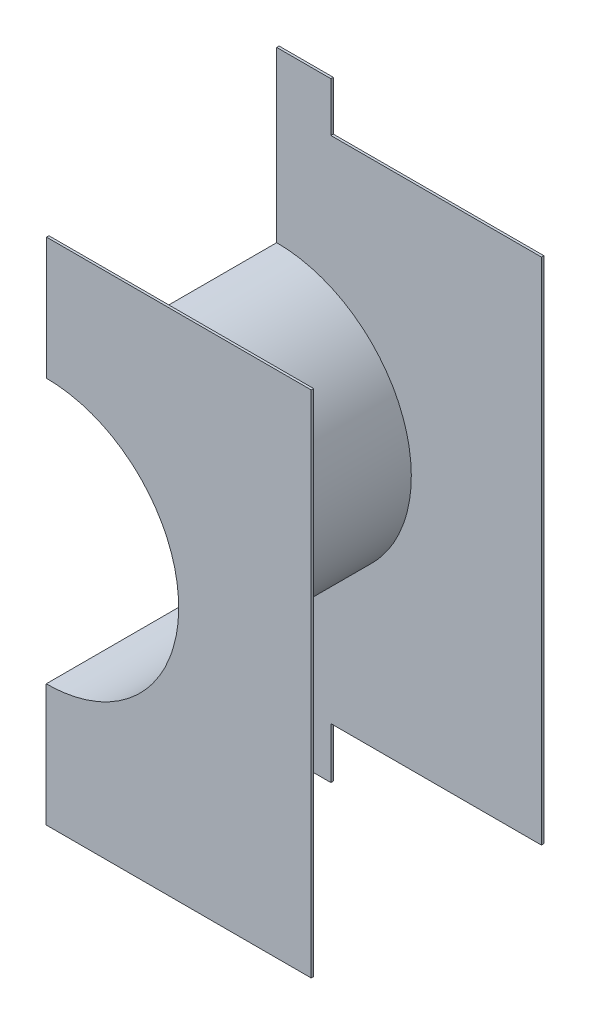
ISO-10303-21;
HEADER;
FILE_DESCRIPTION(('STEP AP214'),'2;1');
FILE_NAME('part.step','',(''),(''),'','','');
FILE_SCHEMA(('AUTOMOTIVE_DESIGN { 1 0 10303 214 1 1 1 1 }'));
ENDSEC;
DATA;
#1=APPLICATION_CONTEXT('core data for automotive mechanical design processes');
#2=APPLICATION_PROTOCOL_DEFINITION('international standard','automotive_design',2000,#1);
#3=PRODUCT_CONTEXT('',#1,'mechanical');
#4=PRODUCT('Part','Part','',(#3));
#5=PRODUCT_RELATED_PRODUCT_CATEGORY('part','',(#4));
#6=PRODUCT_DEFINITION_FORMATION('','',#4);
#7=PRODUCT_DEFINITION_CONTEXT('part definition',#1,'design');
#8=PRODUCT_DEFINITION('design','',#6,#7);
#9=PRODUCT_DEFINITION_SHAPE('','',#8);
#10=(LENGTH_UNIT() NAMED_UNIT(*) SI_UNIT(.MILLI.,.METRE.));
#11=(NAMED_UNIT(*) PLANE_ANGLE_UNIT() SI_UNIT($,.RADIAN.));
#12=(NAMED_UNIT(*) SI_UNIT($,.STERADIAN.) SOLID_ANGLE_UNIT());
#13=UNCERTAINTY_MEASURE_WITH_UNIT(LENGTH_MEASURE(1.E-05),#10,'distance_accuracy_value','');
#14=(GEOMETRIC_REPRESENTATION_CONTEXT(3) GLOBAL_UNCERTAINTY_ASSIGNED_CONTEXT((#13)) GLOBAL_UNIT_ASSIGNED_CONTEXT((#10,
#11,#12)) REPRESENTATION_CONTEXT('',''));
#15=CARTESIAN_POINT('',(0.,0.,0.));
#16=DIRECTION('',(0.,0.,1.));
#17=DIRECTION('',(1.,0.,0.));
#18=AXIS2_PLACEMENT_3D('',#15,#16,#17);
#19=CARTESIAN_POINT('',(0.330340345843,-0.760783826789,0.));
#20=DIRECTION('',(1.,0.,0.));
#21=DIRECTION('',(0.,0.,-1.));
#22=AXIS2_PLACEMENT_3D('',#19,#20,#21);
#23=PLANE('',#22);
#24=DIRECTION('',(0.,0.,-1.));
#25=VECTOR('',#24,1.);
#26=CARTESIAN_POINT('',(0.330340345843,-0.635,0.58));
#27=LINE('',#26,#25);
#28=CARTESIAN_POINT('',(0.330340345843,-0.635,0.574));
#29=VERTEX_POINT('',#28);
#30=CARTESIAN_POINT('',(0.330340345843,-0.635,0.58));
#31=VERTEX_POINT('',#30);
#32=EDGE_CURVE('E270',#29,#31,#27,.F.);
#33=ORIENTED_EDGE('',*,*,#32,.F.);
#34=DIRECTION('',(0.,1.,0.));
#35=VECTOR('',#34,1.);
#36=CARTESIAN_POINT('',(0.330340345843,-0.001069787476899,0.574));
#37=LINE('',#36,#35);
#38=CARTESIAN_POINT('',(0.330340345843,0.635,0.574));
#39=VERTEX_POINT('',#38);
#40=EDGE_CURVE('E290',#29,#39,#37,.T.);
#41=ORIENTED_EDGE('',*,*,#40,.T.);
#42=DIRECTION('',(0.,0.,1.));
#43=VECTOR('',#42,1.);
#44=CARTESIAN_POINT('',(0.330340345843,0.635,0.58));
#45=LINE('',#44,#43);
#46=CARTESIAN_POINT('',(0.330340345843,0.635,0.58));
#47=VERTEX_POINT('',#46);
#48=EDGE_CURVE('E288',#47,#39,#45,.F.);
#49=ORIENTED_EDGE('',*,*,#48,.F.);
#50=DIRECTION('',(0.,1.,0.));
#51=VECTOR('',#50,1.);
#52=CARTESIAN_POINT('',(0.330340345843,-0.001069787476899,0.58));
#53=LINE('',#52,#51);
#54=EDGE_CURVE('E281',#31,#47,#53,.T.);
#55=ORIENTED_EDGE('',*,*,#54,.F.);
#56=EDGE_LOOP('',(#33,#41,#49,#55));
#57=FACE_BOUND('',#56,.T.);
#58=ADVANCED_FACE('F17',(#57),#23,.T.);
#59=CARTESIAN_POINT('',(-0.330340345843,0.635,0.58));
#60=DIRECTION('',(0.,1.,0.));
#61=DIRECTION('',(0.,0.,1.));
#62=AXIS2_PLACEMENT_3D('',#59,#60,#61);
#63=PLANE('',#62);
#64=ORIENTED_EDGE('',*,*,#48,.T.);
#65=DIRECTION('',(1.,0.,0.));
#66=VECTOR('',#65,1.);
#67=CARTESIAN_POINT('',(0.02781893329865,0.635,0.574));
#68=LINE('',#67,#66);
#69=CARTESIAN_POINT('',(-0.329659654157,0.635,0.574));
#70=VERTEX_POINT('',#69);
#71=EDGE_CURVE('E294',#39,#70,#68,.F.);
#72=ORIENTED_EDGE('',*,*,#71,.T.);
#73=DIRECTION('',(0.,0.,1.));
#74=VECTOR('',#73,1.);
#75=CARTESIAN_POINT('',(-0.329659654157,0.635,0.));
#76=LINE('',#75,#74);
#77=CARTESIAN_POINT('',(-0.329659654157,0.635,0.58));
#78=VERTEX_POINT('',#77);
#79=EDGE_CURVE('E214',#78,#70,#76,.F.);
#80=ORIENTED_EDGE('',*,*,#79,.F.);
#81=DIRECTION('',(1.,0.,0.));
#82=VECTOR('',#81,1.);
#83=CARTESIAN_POINT('',(0.02781893329865,0.635,0.58));
#84=LINE('',#83,#82);
#85=EDGE_CURVE('E277',#47,#78,#84,.F.);
#86=ORIENTED_EDGE('',*,*,#85,.F.);
#87=EDGE_LOOP('',(#64,#72,#80,#86));
#88=FACE_BOUND('',#87,.T.);
#89=ADVANCED_FACE('F446',(#88),#63,.T.);
#90=CARTESIAN_POINT('',(0.02781893329865,-0.001069787476899,0.574));
#91=DIRECTION('',(0.,0.,1.));
#92=DIRECTION('',(1.,0.,0.));
#93=AXIS2_PLACEMENT_3D('',#90,#91,#92);
#94=PLANE('',#93);
#95=ORIENTED_EDGE('',*,*,#40,.F.);
#96=DIRECTION('',(1.,0.,0.));
#97=VECTOR('',#96,1.);
#98=CARTESIAN_POINT('',(0.330340345843,-0.635,0.574));
#99=LINE('',#98,#97);
#100=CARTESIAN_POINT('',(-0.330340345843,-0.635,0.574));
#101=VERTEX_POINT('',#100);
#102=EDGE_CURVE('E278',#101,#29,#99,.T.);
#103=ORIENTED_EDGE('',*,*,#102,.F.);
#104=DIRECTION('',(0.,1.,0.));
#105=VECTOR('',#104,1.);
#106=CARTESIAN_POINT('',(-0.330340345843,-0.635,0.574));
#107=LINE('',#106,#105);
#108=CARTESIAN_POINT('',(-0.330340345843,-0.335999827626003,0.574));
#109=VERTEX_POINT('',#108);
#110=EDGE_CURVE('E421',#109,#101,#107,.F.);
#111=ORIENTED_EDGE('',*,*,#110,.F.);
#112=CARTESIAN_POINT('',(-0.33,0.,0.574));
#113=DIRECTION('',(0.,0.,-1.));
#114=DIRECTION('',(0.00101293405643372,0.999999486982167,0.));
#115=AXIS2_PLACEMENT_3D('',#112,#113,#114);
#116=CIRCLE('',#115,0.336);
#117=CARTESIAN_POINT('',(-0.32965965415701,0.335999827649753,0.574));
#118=VERTEX_POINT('',#117);
#119=EDGE_CURVE('E284',#118,#109,#116,.T.);
#120=ORIENTED_EDGE('',*,*,#119,.F.);
#121=DIRECTION('',(0.,1.,0.));
#122=VECTOR('',#121,1.);
#123=CARTESIAN_POINT('',(-0.329659654157,0.759216173211,0.574));
#124=LINE('',#123,#122);
#125=EDGE_CURVE('E321',#70,#118,#124,.F.);
#126=ORIENTED_EDGE('',*,*,#125,.F.);
#127=ORIENTED_EDGE('',*,*,#71,.F.);
#128=EDGE_LOOP('',(#95,#103,#111,#120,#126,#127));
#129=FACE_BOUND('',#128,.T.);
#130=ADVANCED_FACE('F437',(#129),#94,.F.);
#131=CARTESIAN_POINT('',(0.330340345843,-0.635,0.58));
#132=DIRECTION('',(0.,-1.,0.));
#133=DIRECTION('',(0.,0.,-1.));
#134=AXIS2_PLACEMENT_3D('',#131,#132,#133);
#135=PLANE('',#134);
#136=DIRECTION('',(1.,0.,0.));
#137=VECTOR('',#136,1.);
#138=CARTESIAN_POINT('',(0.02781893329865,-0.635,0.58));
#139=LINE('',#138,#137);
#140=CARTESIAN_POINT('',(-0.330340345843,-0.635,0.58));
#141=VERTEX_POINT('',#140);
#142=EDGE_CURVE('E285',#141,#31,#139,.T.);
#143=ORIENTED_EDGE('',*,*,#142,.F.);
#144=DIRECTION('',(0.,0.,1.));
#145=VECTOR('',#144,1.);
#146=CARTESIAN_POINT('',(-0.330340345843,-0.635,0.58));
#147=LINE('',#146,#145);
#148=EDGE_CURVE('E403',#101,#141,#147,.T.);
#149=ORIENTED_EDGE('',*,*,#148,.F.);
#150=ORIENTED_EDGE('',*,*,#102,.T.);
#151=ORIENTED_EDGE('',*,*,#32,.T.);
#152=EDGE_LOOP('',(#143,#149,#150,#151));
#153=FACE_BOUND('',#152,.T.);
#154=ADVANCED_FACE('F445',(#153),#135,.T.);
#155=CARTESIAN_POINT('',(0.02781893329865,-0.001069787476899,0.58));
#156=DIRECTION('',(0.,0.,1.));
#157=DIRECTION('',(1.,0.,0.));
#158=AXIS2_PLACEMENT_3D('',#155,#156,#157);
#159=PLANE('',#158);
#160=ORIENTED_EDGE('',*,*,#142,.T.);
#161=ORIENTED_EDGE('',*,*,#54,.T.);
#162=ORIENTED_EDGE('',*,*,#85,.T.);
#163=DIRECTION('',(0.,1.,0.));
#164=VECTOR('',#163,1.);
#165=CARTESIAN_POINT('',(-0.329659654157,0.759216173211,0.58));
#166=LINE('',#165,#164);
#167=CARTESIAN_POINT('',(-0.329659654157,0.329999824491967,0.58));
#168=VERTEX_POINT('',#167);
#169=EDGE_CURVE('E202',#168,#78,#166,.T.);
#170=ORIENTED_EDGE('',*,*,#169,.F.);
#171=CARTESIAN_POINT('',(-0.329659654157,0.329999824492,0.58));
#172=CARTESIAN_POINT('',(-0.266982841853826,0.329935182662093,0.58));
#173=CARTESIAN_POINT('',(-0.208212360865036,0.306704696661068,0.58));
#174=CARTESIAN_POINT('',(-0.145143369310935,0.281775118057213,0.58));
#175=CARTESIAN_POINT('',(-0.0964142254578492,0.233104452835103,0.58));
#176=CARTESIAN_POINT('',(-0.0484307192201517,0.185178530407263,0.58));
#177=CARTESIAN_POINT('',(-0.0230447443305151,0.121154739968696,0.58));
#178=CARTESIAN_POINT('',(-3.67828967418281E-05,0.0631283333540779,0.58));
#179=CARTESIAN_POINT('',(-1.75508066142371E-07,-0.000340345842999733,0.58));
#180=CARTESIAN_POINT('',(3.58282880240539E-05,-0.062762536187419,0.58));
#181=CARTESIAN_POINT('',(-0.0232953033389743,-0.121787639134969,0.58));
#182=CARTESIAN_POINT('',(-0.0482248819428217,-0.184856630689084,0.58));
#183=CARTESIAN_POINT('',(-0.0968955471649169,-0.23358577454217,0.58));
#184=CARTESIAN_POINT('',(-0.144821469592758,-0.281569280779884,0.58));
#185=CARTESIAN_POINT('',(-0.208845260031309,-0.306955255669527,0.58));
#186=CARTESIAN_POINT('',(-0.26712841051764,-0.33006501822186,0.58));
#187=CARTESIAN_POINT('',(-0.330340345843,-0.329999824492,0.58));
#188=B_SPLINE_CURVE_WITH_KNOTS('',2,(#171,#172,#173,#174,#175,#176,#177,#178,#179,#180,#181,
#182,#183,#184,#185,#186,#187),.UNSPECIFIED.,.F.,.F.,(3,2,2,2,2,2,2,2,3),(0.,0.125,0.25,0.375,
0.5,0.625,0.75,0.875,1.),.UNSPECIFIED.);
#189=CARTESIAN_POINT('',(-0.330340345843,-0.329999824491983,0.58));
#190=VERTEX_POINT('',#189);
#191=EDGE_CURVE('E201',#168,#190,#188,.T.);
#192=ORIENTED_EDGE('',*,*,#191,.T.);
#193=DIRECTION('',(0.,1.,0.));
#194=VECTOR('',#193,1.);
#195=CARTESIAN_POINT('',(-0.330340345843,-0.635,0.58));
#196=LINE('',#195,#194);
#197=EDGE_CURVE('E146',#141,#190,#196,.T.);
#198=ORIENTED_EDGE('',*,*,#197,.F.);
#199=EDGE_LOOP('',(#160,#161,#162,#170,#192,#198));
#200=FACE_BOUND('',#199,.T.);
#201=ADVANCED_FACE('F256',(#200),#159,.T.);
#202=CARTESIAN_POINT('',(-0.33,0.,0.));
#203=DIRECTION('',(0.,0.,1.));
#204=DIRECTION('',(1.,0.,0.));
#205=AXIS2_PLACEMENT_3D('',#202,#203,#204);
#206=CYLINDRICAL_SURFACE('',#205,0.336);
#207=DIRECTION('',(0.,0.,1.));
#208=VECTOR('',#207,1.);
#209=CARTESIAN_POINT('',(-0.329659654157,0.335999827664,0.));
#210=LINE('',#209,#208);
#211=CARTESIAN_POINT('',(-0.32965965415701,0.335999827654502,0.006));
#212=VERTEX_POINT('',#211);
#213=EDGE_CURVE('E313',#118,#212,#210,.F.);
#214=ORIENTED_EDGE('',*,*,#213,.F.);
#215=ORIENTED_EDGE('',*,*,#119,.T.);
#216=DIRECTION('',(0.,0.,1.));
#217=VECTOR('',#216,1.);
#218=CARTESIAN_POINT('',(-0.330340345843,-0.335999827626,0.58));
#219=LINE('',#218,#217);
#220=CARTESIAN_POINT('',(-0.330340345843,-0.335999827626002,0.00600000000000002));
#221=VERTEX_POINT('',#220);
#222=EDGE_CURVE('E315',#221,#109,#219,.T.);
#223=ORIENTED_EDGE('',*,*,#222,.F.);
#224=CARTESIAN_POINT('',(-0.329659654157,0.335999827664,0.006));
#225=CARTESIAN_POINT('',(-0.26583836238212,0.335935180863654,0.006));
#226=CARTESIAN_POINT('',(-0.206003791454036,0.312283429405446,0.006));
#227=CARTESIAN_POINT('',(-0.141779403355028,0.286896445905572,0.006));
#228=CARTESIAN_POINT('',(-0.0921715825546136,0.237347095749475,0.006));
#229=CARTESIAN_POINT('',(-0.0433093913833842,0.188542496380394,0.006));
#230=CARTESIAN_POINT('',(-0.0174660116101208,0.123363309382388,0.006));
#231=CARTESIAN_POINT('',(0.00596322683989083,0.0642727907446489,0.006));
#232=CARTESIAN_POINT('',(0.00599982762600817,-0.000340345842980596,0.006));
#233=CARTESIAN_POINT('',(0.00603583562097266,-0.0639069995598871,0.006));
#234=CARTESIAN_POINT('',(-0.0177165706185686,-0.123996208545957,0.006));
#235=CARTESIAN_POINT('',(-0.0431035541111863,-0.188220596644974,0.006));
#236=CARTESIAN_POINT('',(-0.0926529042616657,-0.237828417445386,0.006));
#237=CARTESIAN_POINT('',(-0.141457503625223,-0.286690608616623,0.006));
#238=CARTESIAN_POINT('',(-0.206636690620298,-0.312533988389879,0.006));
#239=CARTESIAN_POINT('',(-0.265983931285183,-0.336065016463508,0.006));
#240=CARTESIAN_POINT('',(-0.330340345843,-0.335999827626,0.006));
#241=B_SPLINE_CURVE_WITH_KNOTS('',2,(#224,#225,#226,#227,#228,#229,#230,#231,#232,#233,#234,
#235,#236,#237,#238,#239,#240),.UNSPECIFIED.,.F.,.F.,(3,2,2,2,2,2,2,2,3),(0.,0.125,0.25,0.375,
0.5,0.625,0.75,0.875,1.),.UNSPECIFIED.);
#242=EDGE_CURVE('E233',#212,#221,#241,.T.);
#243=ORIENTED_EDGE('',*,*,#242,.F.);
#244=EDGE_LOOP('',(#214,#215,#223,#243));
#245=FACE_BOUND('',#244,.T.);
#246=ADVANCED_FACE('F251',(#245),#206,.T.);
#247=CARTESIAN_POINT('',(0.02781893329865,-0.001069787476899,0.006));
#248=DIRECTION('',(0.,0.,1.));
#249=DIRECTION('',(1.,0.,0.));
#250=AXIS2_PLACEMENT_3D('',#247,#248,#249);
#251=PLANE('',#250);
#252=DIRECTION('',(1.,0.,0.));
#253=VECTOR('',#252,1.);
#254=CARTESIAN_POINT('',(0.330340345843,-0.635,0.00600000000000004));
#255=LINE('',#254,#253);
#256=CARTESIAN_POINT('',(0.330340345843,-0.635,0.00600000000000001));
#257=VERTEX_POINT('',#256);
#258=CARTESIAN_POINT('',(-0.194599178732,-0.635,0.00600000000000001));
#259=VERTEX_POINT('',#258);
#260=EDGE_CURVE('E180',#257,#259,#255,.F.);
#261=ORIENTED_EDGE('',*,*,#260,.F.);
#262=DIRECTION('',(0.,1.,0.));
#263=VECTOR('',#262,1.);
#264=CARTESIAN_POINT('',(0.330340345843,-0.760783826789,0.006));
#265=LINE('',#264,#263);
#266=CARTESIAN_POINT('',(0.330340345843,0.635,0.00600000000000001));
#267=VERTEX_POINT('',#266);
#268=EDGE_CURVE('E178',#267,#257,#265,.F.);
#269=ORIENTED_EDGE('',*,*,#268,.F.);
#270=DIRECTION('',(1.,0.,0.));
#271=VECTOR('',#270,1.);
#272=CARTESIAN_POINT('',(-0.330340345843,0.635,0.00600000000000004));
#273=LINE('',#272,#271);
#274=CARTESIAN_POINT('',(-0.194599178732,0.635,0.00600000000000002));
#275=VERTEX_POINT('',#274);
#276=EDGE_CURVE('E174',#275,#267,#273,.T.);
#277=ORIENTED_EDGE('',*,*,#276,.F.);
#278=DIRECTION('',(0.,1.,0.));
#279=VECTOR('',#278,1.);
#280=CARTESIAN_POINT('',(-0.194599178732,0.635,0.006));
#281=LINE('',#280,#279);
#282=CARTESIAN_POINT('',(-0.194599178732,0.757662112361,0.006));
#283=VERTEX_POINT('',#282);
#284=EDGE_CURVE('E238',#283,#275,#281,.F.);
#285=ORIENTED_EDGE('',*,*,#284,.F.);
#286=DIRECTION('',(1.,0.,0.));
#287=VECTOR('',#286,1.);
#288=CARTESIAN_POINT('',(-0.194599178732,0.757662112361,0.006));
#289=LINE('',#288,#287);
#290=CARTESIAN_POINT('',(-0.329659654157,0.757662112361,0.006));
#291=VERTEX_POINT('',#290);
#292=EDGE_CURVE('E215',#291,#283,#289,.T.);
#293=ORIENTED_EDGE('',*,*,#292,.F.);
#294=DIRECTION('',(0.,1.,0.));
#295=VECTOR('',#294,1.);
#296=CARTESIAN_POINT('',(-0.329659654157,0.759216173211,0.006));
#297=LINE('',#296,#295);
#298=EDGE_CURVE('E207',#212,#291,#297,.T.);
#299=ORIENTED_EDGE('',*,*,#298,.F.);
#300=ORIENTED_EDGE('',*,*,#242,.T.);
#301=DIRECTION('',(0.,1.,0.));
#302=VECTOR('',#301,1.);
#303=CARTESIAN_POINT('',(-0.330340345843,-0.635,0.00600000000000004));
#304=LINE('',#303,#302);
#305=CARTESIAN_POINT('',(-0.33,-0.635,0.00600000000000002));
#306=VERTEX_POINT('',#305);
#307=EDGE_CURVE('E148',#306,#221,#304,.T.);
#308=ORIENTED_EDGE('',*,*,#307,.F.);
#309=DIRECTION('',(0.,1.,0.));
#310=VECTOR('',#309,1.);
#311=CARTESIAN_POINT('',(-0.329659654157,-0.635,0.006));
#312=LINE('',#311,#310);
#313=CARTESIAN_POINT('',(-0.329659654157,-0.762439620436,0.006));
#314=VERTEX_POINT('',#313);
#315=EDGE_CURVE('E350',#314,#306,#312,.T.);
#316=ORIENTED_EDGE('',*,*,#315,.F.);
#317=DIRECTION('',(1.,0.,0.));
#318=VECTOR('',#317,1.);
#319=CARTESIAN_POINT('',(-0.329659654157,-0.762439620436,0.006));
#320=LINE('',#319,#318);
#321=CARTESIAN_POINT('',(-0.194599178732,-0.762439620436,0.006));
#322=VERTEX_POINT('',#321);
#323=EDGE_CURVE('E195',#322,#314,#320,.F.);
#324=ORIENTED_EDGE('',*,*,#323,.F.);
#325=DIRECTION('',(0.,1.,0.));
#326=VECTOR('',#325,1.);
#327=CARTESIAN_POINT('',(-0.194599178732,-0.762439620436,0.006));
#328=LINE('',#327,#326);
#329=EDGE_CURVE('E194',#259,#322,#328,.F.);
#330=ORIENTED_EDGE('',*,*,#329,.F.);
#331=EDGE_LOOP('',(#261,#269,#277,#285,#293,#299,#300,#308,#316,#324,#330));
#332=FACE_BOUND('',#331,.T.);
#333=ADVANCED_FACE('F240',(#332),#251,.T.);
#334=CARTESIAN_POINT('',(-0.194599178732,0.635,0.));
#335=DIRECTION('',(1.,0.,0.));
#336=DIRECTION('',(0.,0.,-1.));
#337=AXIS2_PLACEMENT_3D('',#334,#335,#336);
#338=PLANE('',#337);
#339=DIRECTION('',(0.,1.,0.));
#340=VECTOR('',#339,1.);
#341=CARTESIAN_POINT('',(-0.194599178732,-0.001069787476899,0.));
#342=LINE('',#341,#340);
#343=CARTESIAN_POINT('',(-0.194599178732,0.635,0.));
#344=VERTEX_POINT('',#343);
#345=CARTESIAN_POINT('',(-0.194599178732,0.757662112361,0.));
#346=VERTEX_POINT('',#345);
#347=EDGE_CURVE('E166',#344,#346,#342,.T.);
#348=ORIENTED_EDGE('',*,*,#347,.T.);
#349=DIRECTION('',(0.,0.,1.));
#350=VECTOR('',#349,1.);
#351=CARTESIAN_POINT('',(-0.194599178732,0.757662112361,0.));
#352=LINE('',#351,#350);
#353=EDGE_CURVE('E212',#283,#346,#352,.F.);
#354=ORIENTED_EDGE('',*,*,#353,.F.);
#355=ORIENTED_EDGE('',*,*,#284,.T.);
#356=DIRECTION('',(0.,0.,1.));
#357=VECTOR('',#356,1.);
#358=CARTESIAN_POINT('',(-0.194599178732,0.635,0.58));
#359=LINE('',#358,#357);
#360=EDGE_CURVE('E177',#344,#275,#359,.T.);
#361=ORIENTED_EDGE('',*,*,#360,.F.);
#362=EDGE_LOOP('',(#348,#354,#355,#361));
#363=FACE_BOUND('',#362,.T.);
#364=ADVANCED_FACE('F250',(#363),#338,.T.);
#365=CARTESIAN_POINT('',(-0.194599178732,0.757662112361,0.));
#366=DIRECTION('',(0.,1.,0.));
#367=DIRECTION('',(0.,0.,1.));
#368=AXIS2_PLACEMENT_3D('',#365,#366,#367);
#369=PLANE('',#368);
#370=DIRECTION('',(1.,0.,0.));
#371=VECTOR('',#370,1.);
#372=CARTESIAN_POINT('',(0.02781893329865,0.757662112361,0.));
#373=LINE('',#372,#371);
#374=CARTESIAN_POINT('',(-0.329659654157,0.757662112361,0.));
#375=VERTEX_POINT('',#374);
#376=EDGE_CURVE('E162',#346,#375,#373,.F.);
#377=ORIENTED_EDGE('',*,*,#376,.T.);
#378=DIRECTION('',(0.,0.,1.));
#379=VECTOR('',#378,1.);
#380=CARTESIAN_POINT('',(-0.329659654157,0.757662112361,0.));
#381=LINE('',#380,#379);
#382=EDGE_CURVE('E205',#291,#375,#381,.F.);
#383=ORIENTED_EDGE('',*,*,#382,.F.);
#384=ORIENTED_EDGE('',*,*,#292,.T.);
#385=ORIENTED_EDGE('',*,*,#353,.T.);
#386=EDGE_LOOP('',(#377,#383,#384,#385));
#387=FACE_BOUND('',#386,.T.);
#388=ADVANCED_FACE('F547',(#387),#369,.T.);
#389=CARTESIAN_POINT('',(-0.329659654157,0.759216173211,0.));
#390=DIRECTION('',(-1.,0.,0.));
#391=DIRECTION('',(0.,0.,1.));
#392=AXIS2_PLACEMENT_3D('',#389,#390,#391);
#393=PLANE('',#392);
#394=DIRECTION('',(0.,0.,1.));
#395=VECTOR('',#394,1.);
#396=CARTESIAN_POINT('',(-0.329659654157,0.329999824491934,0.));
#397=LINE('',#396,#395);
#398=CARTESIAN_POINT('',(-0.329659654157,0.329999824491934,0.));
#399=VERTEX_POINT('',#398);
#400=EDGE_CURVE('E133',#399,#168,#397,.T.);
#401=ORIENTED_EDGE('',*,*,#400,.T.);
#402=ORIENTED_EDGE('',*,*,#169,.T.);
#403=ORIENTED_EDGE('',*,*,#79,.T.);
#404=ORIENTED_EDGE('',*,*,#125,.T.);
#405=ORIENTED_EDGE('',*,*,#213,.T.);
#406=ORIENTED_EDGE('',*,*,#298,.T.);
#407=ORIENTED_EDGE('',*,*,#382,.T.);
#408=DIRECTION('',(0.,1.,0.));
#409=VECTOR('',#408,1.);
#410=CARTESIAN_POINT('',(-0.329659654157,-0.001069787476899,0.));
#411=LINE('',#410,#409);
#412=EDGE_CURVE('E161',#375,#399,#411,.F.);
#413=ORIENTED_EDGE('',*,*,#412,.T.);
#414=EDGE_LOOP('',(#401,#402,#403,#404,#405,#406,#407,#413));
#415=FACE_BOUND('',#414,.T.);
#416=ADVANCED_FACE('F554',(#415),#393,.T.);
#417=CARTESIAN_POINT('',(-0.33,0.,0.));
#418=DIRECTION('',(0.,0.,1.));
#419=DIRECTION('',(1.,0.,0.));
#420=AXIS2_PLACEMENT_3D('',#417,#418,#419);
#421=CYLINDRICAL_SURFACE('',#420,0.33);
#422=ORIENTED_EDGE('',*,*,#191,.F.);
#423=ORIENTED_EDGE('',*,*,#400,.F.);
#424=CARTESIAN_POINT('',(-0.33,0.,0.));
#425=DIRECTION('',(0.,0.,1.));
#426=DIRECTION('',(1.,0.,0.));
#427=AXIS2_PLACEMENT_3D('',#424,#425,#426);
#428=CIRCLE('',#427,0.33);
#429=CARTESIAN_POINT('',(-0.330340345843,-0.329999824491967,0.));
#430=VERTEX_POINT('',#429);
#431=EDGE_CURVE('E20',#399,#430,#428,.F.);
#432=ORIENTED_EDGE('',*,*,#431,.T.);
#433=DIRECTION('',(0.,0.,1.));
#434=VECTOR('',#433,1.);
#435=CARTESIAN_POINT('',(-0.330340345843,-0.329999824492,0.58));
#436=LINE('',#435,#434);
#437=EDGE_CURVE('E139',#190,#430,#436,.F.);
#438=ORIENTED_EDGE('',*,*,#437,.F.);
#439=EDGE_LOOP('',(#422,#423,#432,#438));
#440=FACE_BOUND('',#439,.T.);
#441=ADVANCED_FACE('F160',(#440),#421,.F.);
#442=CARTESIAN_POINT('',(-0.330340345843,-0.635,0.58));
#443=DIRECTION('',(-1.,0.,0.));
#444=DIRECTION('',(0.,0.,1.));
#445=AXIS2_PLACEMENT_3D('',#442,#443,#444);
#446=PLANE('',#445);
#447=ORIENTED_EDGE('',*,*,#307,.T.);
#448=ORIENTED_EDGE('',*,*,#222,.T.);
#449=ORIENTED_EDGE('',*,*,#110,.T.);
#450=ORIENTED_EDGE('',*,*,#148,.T.);
#451=ORIENTED_EDGE('',*,*,#197,.T.);
#452=ORIENTED_EDGE('',*,*,#437,.T.);
#453=DIRECTION('',(0.,1.,0.));
#454=VECTOR('',#453,1.);
#455=CARTESIAN_POINT('',(-0.330340345843,-0.001069787476899,0.));
#456=LINE('',#455,#454);
#457=CARTESIAN_POINT('',(-0.33,-0.635,0.));
#458=VERTEX_POINT('',#457);
#459=EDGE_CURVE('E144',#430,#458,#456,.F.);
#460=ORIENTED_EDGE('',*,*,#459,.T.);
#461=CARTESIAN_POINT('',(-0.329659654157,-0.635,0.006));
#462=DIRECTION('',(0.,0.,-1.));
#463=VECTOR('',#462,1.);
#464=LINE('',#461,#463);
#465=EDGE_CURVE('E352',#306,#458,#464,.T.);
#466=ORIENTED_EDGE('',*,*,#465,.F.);
#467=EDGE_LOOP('',(#447,#448,#449,#450,#451,#452,#460,#466));
#468=FACE_BOUND('',#467,.T.);
#469=ADVANCED_FACE('F142',(#468),#446,.T.);
#470=CARTESIAN_POINT('',(-0.329659654157,-0.635,0.));
#471=DIRECTION('',(-1.,0.,0.));
#472=DIRECTION('',(0.,0.,1.));
#473=AXIS2_PLACEMENT_3D('',#470,#471,#472);
#474=PLANE('',#473);
#475=DIRECTION('',(0.,1.,0.));
#476=VECTOR('',#475,1.);
#477=CARTESIAN_POINT('',(-0.329659654157,-0.001069787476899,0.));
#478=LINE('',#477,#476);
#479=CARTESIAN_POINT('',(-0.329659654157,-0.762439620436,0.));
#480=VERTEX_POINT('',#479);
#481=EDGE_CURVE('E158',#458,#480,#478,.F.);
#482=ORIENTED_EDGE('',*,*,#481,.T.);
#483=DIRECTION('',(0.,0.,-1.));
#484=VECTOR('',#483,1.);
#485=CARTESIAN_POINT('',(-0.329659654157,-0.762439620436,0.));
#486=LINE('',#485,#484);
#487=EDGE_CURVE('E192',#314,#480,#486,.T.);
#488=ORIENTED_EDGE('',*,*,#487,.F.);
#489=ORIENTED_EDGE('',*,*,#315,.T.);
#490=ORIENTED_EDGE('',*,*,#465,.T.);
#491=EDGE_LOOP('',(#482,#488,#489,#490));
#492=FACE_BOUND('',#491,.T.);
#493=ADVANCED_FACE('F371',(#492),#474,.T.);
#494=CARTESIAN_POINT('',(-0.329659654157,-0.762439620436,0.));
#495=DIRECTION('',(0.,-1.,0.));
#496=DIRECTION('',(0.,0.,-1.));
#497=AXIS2_PLACEMENT_3D('',#494,#495,#496);
#498=PLANE('',#497);
#499=DIRECTION('',(1.,0.,0.));
#500=VECTOR('',#499,1.);
#501=CARTESIAN_POINT('',(0.02781893329865,-0.762439620436,0.));
#502=LINE('',#501,#500);
#503=CARTESIAN_POINT('',(-0.194599178732,-0.762439620436,0.));
#504=VERTEX_POINT('',#503);
#505=EDGE_CURVE('E186',#480,#504,#502,.T.);
#506=ORIENTED_EDGE('',*,*,#505,.T.);
#507=DIRECTION('',(0.,0.,-1.));
#508=VECTOR('',#507,1.);
#509=CARTESIAN_POINT('',(-0.194599178732,-0.762439620436,0.));
#510=LINE('',#509,#508);
#511=EDGE_CURVE('E185',#322,#504,#510,.T.);
#512=ORIENTED_EDGE('',*,*,#511,.F.);
#513=ORIENTED_EDGE('',*,*,#323,.T.);
#514=ORIENTED_EDGE('',*,*,#487,.T.);
#515=EDGE_LOOP('',(#506,#512,#513,#514));
#516=FACE_BOUND('',#515,.T.);
#517=ADVANCED_FACE('F381',(#516),#498,.T.);
#518=CARTESIAN_POINT('',(-0.194599178732,-0.762439620436,0.));
#519=DIRECTION('',(1.,0.,0.));
#520=DIRECTION('',(0.,0.,-1.));
#521=AXIS2_PLACEMENT_3D('',#518,#519,#520);
#522=PLANE('',#521);
#523=DIRECTION('',(0.,1.,0.));
#524=VECTOR('',#523,1.);
#525=CARTESIAN_POINT('',(-0.194599178732,-0.001069787476899,0.));
#526=LINE('',#525,#524);
#527=CARTESIAN_POINT('',(-0.194599178732,-0.635,0.));
#528=VERTEX_POINT('',#527);
#529=EDGE_CURVE('E189',#504,#528,#526,.T.);
#530=ORIENTED_EDGE('',*,*,#529,.T.);
#531=DIRECTION('',(0.,0.,-1.));
#532=VECTOR('',#531,1.);
#533=CARTESIAN_POINT('',(-0.194599178732,-0.635,0.58));
#534=LINE('',#533,#532);
#535=EDGE_CURVE('E183',#259,#528,#534,.T.);
#536=ORIENTED_EDGE('',*,*,#535,.F.);
#537=ORIENTED_EDGE('',*,*,#329,.T.);
#538=ORIENTED_EDGE('',*,*,#511,.T.);
#539=EDGE_LOOP('',(#530,#536,#537,#538));
#540=FACE_BOUND('',#539,.T.);
#541=ADVANCED_FACE('F465',(#540),#522,.T.);
#542=CARTESIAN_POINT('',(0.330340345843,-0.635,0.58));
#543=DIRECTION('',(0.,-1.,0.));
#544=DIRECTION('',(0.,0.,-1.));
#545=AXIS2_PLACEMENT_3D('',#542,#543,#544);
#546=PLANE('',#545);
#547=DIRECTION('',(0.,0.,-1.));
#548=VECTOR('',#547,1.);
#549=CARTESIAN_POINT('',(0.330340345843,-0.635,0.));
#550=LINE('',#549,#548);
#551=CARTESIAN_POINT('',(0.330340345843,-0.635,0.));
#552=VERTEX_POINT('',#551);
#553=EDGE_CURVE('E175',#257,#552,#550,.T.);
#554=ORIENTED_EDGE('',*,*,#553,.F.);
#555=ORIENTED_EDGE('',*,*,#260,.T.);
#556=ORIENTED_EDGE('',*,*,#535,.T.);
#557=DIRECTION('',(1.,0.,0.));
#558=VECTOR('',#557,1.);
#559=CARTESIAN_POINT('',(0.02781893329865,-0.635,0.));
#560=LINE('',#559,#558);
#561=EDGE_CURVE('E478',#528,#552,#560,.T.);
#562=ORIENTED_EDGE('',*,*,#561,.T.);
#563=EDGE_LOOP('',(#554,#555,#556,#562));
#564=FACE_BOUND('',#563,.T.);
#565=ADVANCED_FACE('F462',(#564),#546,.T.);
#566=CARTESIAN_POINT('',(0.330340345843,-0.760783826789,0.));
#567=DIRECTION('',(1.,0.,0.));
#568=DIRECTION('',(0.,0.,-1.));
#569=AXIS2_PLACEMENT_3D('',#566,#567,#568);
#570=PLANE('',#569);
#571=ORIENTED_EDGE('',*,*,#553,.T.);
#572=DIRECTION('',(0.,1.,0.));
#573=VECTOR('',#572,1.);
#574=CARTESIAN_POINT('',(0.330340345843,-0.001069787476899,0.));
#575=LINE('',#574,#573);
#576=CARTESIAN_POINT('',(0.330340345843,0.635,0.));
#577=VERTEX_POINT('',#576);
#578=EDGE_CURVE('E26',#552,#577,#575,.T.);
#579=ORIENTED_EDGE('',*,*,#578,.T.);
#580=DIRECTION('',(0.,0.,1.));
#581=VECTOR('',#580,1.);
#582=CARTESIAN_POINT('',(0.330340345843,0.635,0.58));
#583=LINE('',#582,#581);
#584=EDGE_CURVE('E34',#267,#577,#583,.F.);
#585=ORIENTED_EDGE('',*,*,#584,.F.);
#586=ORIENTED_EDGE('',*,*,#268,.T.);
#587=EDGE_LOOP('',(#571,#579,#585,#586));
#588=FACE_BOUND('',#587,.T.);
#589=ADVANCED_FACE('F457',(#588),#570,.T.);
#590=CARTESIAN_POINT('',(-0.330340345843,0.635,0.58));
#591=DIRECTION('',(0.,1.,0.));
#592=DIRECTION('',(0.,0.,1.));
#593=AXIS2_PLACEMENT_3D('',#590,#591,#592);
#594=PLANE('',#593);
#595=ORIENTED_EDGE('',*,*,#584,.T.);
#596=DIRECTION('',(1.,0.,0.));
#597=VECTOR('',#596,1.);
#598=CARTESIAN_POINT('',(0.02781893329865,0.635,0.));
#599=LINE('',#598,#597);
#600=EDGE_CURVE('E11',#577,#344,#599,.F.);
#601=ORIENTED_EDGE('',*,*,#600,.T.);
#602=ORIENTED_EDGE('',*,*,#360,.T.);
#603=ORIENTED_EDGE('',*,*,#276,.T.);
#604=EDGE_LOOP('',(#595,#601,#602,#603));
#605=FACE_BOUND('',#604,.T.);
#606=ADVANCED_FACE('F343',(#605),#594,.T.);
#607=CARTESIAN_POINT('',(0.02781893329865,-0.001069787476899,0.));
#608=DIRECTION('',(0.,0.,1.));
#609=DIRECTION('',(1.,0.,0.));
#610=AXIS2_PLACEMENT_3D('',#607,#608,#609);
#611=PLANE('',#610);
#612=ORIENTED_EDGE('',*,*,#578,.F.);
#613=ORIENTED_EDGE('',*,*,#561,.F.);
#614=ORIENTED_EDGE('',*,*,#529,.F.);
#615=ORIENTED_EDGE('',*,*,#505,.F.);
#616=ORIENTED_EDGE('',*,*,#481,.F.);
#617=ORIENTED_EDGE('',*,*,#459,.F.);
#618=ORIENTED_EDGE('',*,*,#431,.F.);
#619=ORIENTED_EDGE('',*,*,#412,.F.);
#620=ORIENTED_EDGE('',*,*,#376,.F.);
#621=ORIENTED_EDGE('',*,*,#347,.F.);
#622=ORIENTED_EDGE('',*,*,#600,.F.);
#623=EDGE_LOOP('',(#612,#613,#614,#615,#616,#617,#618,#619,#620,#621,#622));
#624=FACE_BOUND('',#623,.T.);
#625=ADVANCED_FACE('F153',(#624),#611,.F.);
#626=CLOSED_SHELL('',(#58,#89,#130,#154,#201,#246,#333,#364,#388,#416,#441,#469,#493,#517,#541,
#565,#589,#606,#625));
#627=MANIFOLD_SOLID_BREP('B1',#626);
#628=ADVANCED_BREP_SHAPE_REPRESENTATION('',(#18,#627),#14);
#629=SHAPE_DEFINITION_REPRESENTATION(#9,#628);
ENDSEC;
END-ISO-10303-21;
